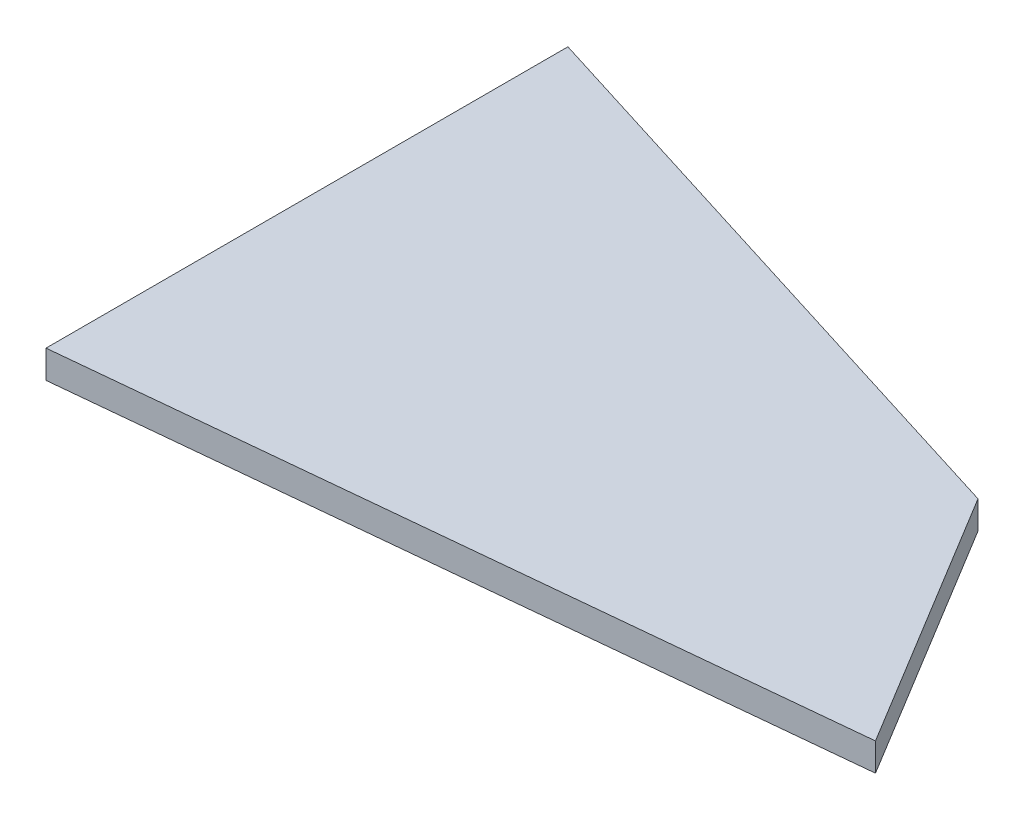
ISO-10303-21;
HEADER;
FILE_DESCRIPTION(('STEP AP214'),'2;1');
FILE_NAME('part.step','',(''),(''),'','','');
FILE_SCHEMA(('AUTOMOTIVE_DESIGN { 1 0 10303 214 1 1 1 1 }'));
ENDSEC;
DATA;
#1=APPLICATION_CONTEXT('core data for automotive mechanical design processes');
#2=APPLICATION_PROTOCOL_DEFINITION('international standard','automotive_design',2000,#1);
#3=PRODUCT_CONTEXT('',#1,'mechanical');
#4=PRODUCT('Part','Part','',(#3));
#5=PRODUCT_RELATED_PRODUCT_CATEGORY('part','',(#4));
#6=PRODUCT_DEFINITION_FORMATION('','',#4);
#7=PRODUCT_DEFINITION_CONTEXT('part definition',#1,'design');
#8=PRODUCT_DEFINITION('design','',#6,#7);
#9=PRODUCT_DEFINITION_SHAPE('','',#8);
#10=(LENGTH_UNIT() NAMED_UNIT(*) SI_UNIT(.MILLI.,.METRE.));
#11=(NAMED_UNIT(*) PLANE_ANGLE_UNIT() SI_UNIT($,.RADIAN.));
#12=(NAMED_UNIT(*) SI_UNIT($,.STERADIAN.) SOLID_ANGLE_UNIT());
#13=UNCERTAINTY_MEASURE_WITH_UNIT(LENGTH_MEASURE(1.E-05),#10,'distance_accuracy_value','');
#14=(GEOMETRIC_REPRESENTATION_CONTEXT(3) GLOBAL_UNCERTAINTY_ASSIGNED_CONTEXT((#13)) GLOBAL_UNIT_ASSIGNED_CONTEXT((#10,
#11,#12)) REPRESENTATION_CONTEXT('',''));
#15=CARTESIAN_POINT('',(0.,0.,0.));
#16=DIRECTION('',(0.,0.,1.));
#17=DIRECTION('',(1.,0.,0.));
#18=AXIS2_PLACEMENT_3D('',#15,#16,#17);
#19=CARTESIAN_POINT('',(128.5875,4.7625,-12.7));
#20=DIRECTION('',(-0.0982872186934322,0.,-0.995158089271001));
#21=DIRECTION('',(-0.995158089271001,0.,0.0982872186934322));
#22=AXIS2_PLACEMENT_3D('',#19,#20,#21);
#23=PLANE('',#22);
#24=DIRECTION('',(0.995158089271001,0.,-0.0982872186934322));
#25=VECTOR('',#24,1.);
#26=CARTESIAN_POINT('',(128.5875,0.,-12.7));
#27=LINE('',#26,#25);
#28=CARTESIAN_POINT('',(0.,0.,0.));
#29=VERTEX_POINT('',#28);
#30=CARTESIAN_POINT('',(128.5875,0.,-12.7));
#31=VERTEX_POINT('',#30);
#32=EDGE_CURVE('E96',#29,#31,#27,.T.);
#33=ORIENTED_EDGE('',*,*,#32,.T.);
#34=DIRECTION('',(0.,-1.,0.));
#35=VECTOR('',#34,1.);
#36=CARTESIAN_POINT('',(128.5875,4.7625,-12.7));
#37=LINE('',#36,#35);
#38=CARTESIAN_POINT('',(128.5875,4.7625,-12.7));
#39=VERTEX_POINT('',#38);
#40=EDGE_CURVE('E11',#39,#31,#37,.T.);
#41=ORIENTED_EDGE('',*,*,#40,.F.);
#42=DIRECTION('',(0.995158089271001,0.,-0.0982872186934322));
#43=VECTOR('',#42,1.);
#44=CARTESIAN_POINT('',(128.5875,4.7625,-12.7));
#45=LINE('',#44,#43);
#46=CARTESIAN_POINT('',(0.,4.7625,0.));
#47=VERTEX_POINT('',#46);
#48=EDGE_CURVE('E84',#47,#39,#45,.T.);
#49=ORIENTED_EDGE('',*,*,#48,.F.);
#50=DIRECTION('',(0.,-1.,0.));
#51=VECTOR('',#50,1.);
#52=CARTESIAN_POINT('',(0.,4.7625,0.));
#53=LINE('',#52,#51);
#54=EDGE_CURVE('E92',#47,#29,#53,.T.);
#55=ORIENTED_EDGE('',*,*,#54,.T.);
#56=EDGE_LOOP('',(#33,#41,#49,#55));
#57=FACE_BOUND('',#56,.T.);
#58=ADVANCED_FACE('F33',(#57),#23,.F.);
#59=CARTESIAN_POINT('',(101.6,4.7625,-57.15));
#60=DIRECTION('',(-0.854787515221729,0.,0.518978134241764));
#61=DIRECTION('',(0.518978134241764,0.,0.854787515221729));
#62=AXIS2_PLACEMENT_3D('',#59,#60,#61);
#63=PLANE('',#62);
#64=DIRECTION('',(-0.518978134241764,0.,-0.854787515221729));
#65=VECTOR('',#64,1.);
#66=CARTESIAN_POINT('',(101.6,0.,-57.15));
#67=LINE('',#66,#65);
#68=CARTESIAN_POINT('',(101.6,0.,-57.15));
#69=VERTEX_POINT('',#68);
#70=EDGE_CURVE('E88',#31,#69,#67,.T.);
#71=ORIENTED_EDGE('',*,*,#70,.T.);
#72=DIRECTION('',(0.,-1.,0.));
#73=VECTOR('',#72,1.);
#74=CARTESIAN_POINT('',(101.6,4.7625,-57.15));
#75=LINE('',#74,#73);
#76=CARTESIAN_POINT('',(101.6,4.7625,-57.15));
#77=VERTEX_POINT('',#76);
#78=EDGE_CURVE('E41',#77,#69,#75,.T.);
#79=ORIENTED_EDGE('',*,*,#78,.F.);
#80=DIRECTION('',(-0.518978134241764,0.,-0.854787515221729));
#81=VECTOR('',#80,1.);
#82=CARTESIAN_POINT('',(101.6,4.7625,-57.15));
#83=LINE('',#82,#81);
#84=EDGE_CURVE('E79',#39,#77,#83,.T.);
#85=ORIENTED_EDGE('',*,*,#84,.F.);
#86=ORIENTED_EDGE('',*,*,#40,.T.);
#87=EDGE_LOOP('',(#71,#79,#85,#86));
#88=FACE_BOUND('',#87,.T.);
#89=ADVANCED_FACE('F87',(#88),#63,.F.);
#90=CARTESIAN_POINT('',(0.,4.7625,-88.9));
#91=DIRECTION('',(-0.298274993135947,0.,0.95447997803503));
#92=DIRECTION('',(0.95447997803503,0.,0.298274993135947));
#93=AXIS2_PLACEMENT_3D('',#90,#91,#92);
#94=PLANE('',#93);
#95=DIRECTION('',(-0.95447997803503,0.,-0.298274993135947));
#96=VECTOR('',#95,1.);
#97=CARTESIAN_POINT('',(0.,0.,-88.9));
#98=LINE('',#97,#96);
#99=CARTESIAN_POINT('',(0.,0.,-88.9));
#100=VERTEX_POINT('',#99);
#101=EDGE_CURVE('E66',#69,#100,#98,.T.);
#102=ORIENTED_EDGE('',*,*,#101,.T.);
#103=DIRECTION('',(0.,-1.,0.));
#104=VECTOR('',#103,1.);
#105=CARTESIAN_POINT('',(0.,4.7625,-88.9));
#106=LINE('',#105,#104);
#107=CARTESIAN_POINT('',(0.,4.7625,-88.9));
#108=VERTEX_POINT('',#107);
#109=EDGE_CURVE('E89',#108,#100,#106,.T.);
#110=ORIENTED_EDGE('',*,*,#109,.F.);
#111=DIRECTION('',(-0.95447997803503,0.,-0.298274993135947));
#112=VECTOR('',#111,1.);
#113=CARTESIAN_POINT('',(0.,4.7625,-88.9));
#114=LINE('',#113,#112);
#115=EDGE_CURVE('E82',#77,#108,#114,.T.);
#116=ORIENTED_EDGE('',*,*,#115,.F.);
#117=ORIENTED_EDGE('',*,*,#78,.T.);
#118=EDGE_LOOP('',(#102,#110,#116,#117));
#119=FACE_BOUND('',#118,.T.);
#120=ADVANCED_FACE('F90',(#119),#94,.F.);
#121=CARTESIAN_POINT('',(0.,4.7625,0.));
#122=DIRECTION('',(1.,0.,0.));
#123=DIRECTION('',(0.,0.,-1.));
#124=AXIS2_PLACEMENT_3D('',#121,#122,#123);
#125=PLANE('',#124);
#126=DIRECTION('',(0.,0.,1.));
#127=VECTOR('',#126,1.);
#128=CARTESIAN_POINT('',(0.,0.,0.));
#129=LINE('',#128,#127);
#130=EDGE_CURVE('E72',#100,#29,#129,.T.);
#131=ORIENTED_EDGE('',*,*,#130,.T.);
#132=ORIENTED_EDGE('',*,*,#54,.F.);
#133=DIRECTION('',(0.,0.,1.));
#134=VECTOR('',#133,1.);
#135=CARTESIAN_POINT('',(0.,4.7625,0.));
#136=LINE('',#135,#134);
#137=EDGE_CURVE('E49',#108,#47,#136,.T.);
#138=ORIENTED_EDGE('',*,*,#137,.F.);
#139=ORIENTED_EDGE('',*,*,#109,.T.);
#140=EDGE_LOOP('',(#131,#132,#138,#139));
#141=FACE_BOUND('',#140,.T.);
#142=ADVANCED_FACE('F103',(#141),#125,.F.);
#143=CARTESIAN_POINT('',(0.,4.7625,0.));
#144=DIRECTION('',(0.,-1.,0.));
#145=DIRECTION('',(0.,0.,-1.));
#146=AXIS2_PLACEMENT_3D('',#143,#144,#145);
#147=PLANE('',#146);
#148=ORIENTED_EDGE('',*,*,#48,.T.);
#149=ORIENTED_EDGE('',*,*,#84,.T.);
#150=ORIENTED_EDGE('',*,*,#115,.T.);
#151=ORIENTED_EDGE('',*,*,#137,.T.);
#152=EDGE_LOOP('',(#148,#149,#150,#151));
#153=FACE_BOUND('',#152,.T.);
#154=ADVANCED_FACE('F80',(#153),#147,.F.);
#155=CARTESIAN_POINT('',(0.,0.,0.));
#156=DIRECTION('',(0.,-1.,0.));
#157=DIRECTION('',(0.,0.,-1.));
#158=AXIS2_PLACEMENT_3D('',#155,#156,#157);
#159=PLANE('',#158);
#160=ORIENTED_EDGE('',*,*,#32,.F.);
#161=ORIENTED_EDGE('',*,*,#130,.F.);
#162=ORIENTED_EDGE('',*,*,#101,.F.);
#163=ORIENTED_EDGE('',*,*,#70,.F.);
#164=EDGE_LOOP('',(#160,#161,#162,#163));
#165=FACE_BOUND('',#164,.T.);
#166=ADVANCED_FACE('F106',(#165),#159,.T.);
#167=CLOSED_SHELL('',(#58,#89,#120,#142,#154,#166));
#168=MANIFOLD_SOLID_BREP('B2',#167);
#169=ADVANCED_BREP_SHAPE_REPRESENTATION('',(#18,#168),#14);
#170=SHAPE_DEFINITION_REPRESENTATION(#9,#169);
ENDSEC;
END-ISO-10303-21;
